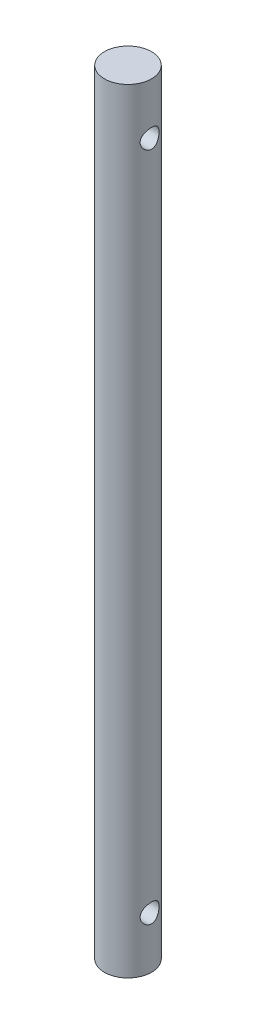
ISO-10303-21;
HEADER;
FILE_DESCRIPTION(('STEP AP214'),'2;1');
FILE_NAME('part.step','',(''),(''),'','','');
FILE_SCHEMA(('AUTOMOTIVE_DESIGN { 1 0 10303 214 1 1 1 1 }'));
ENDSEC;
DATA;
#1=APPLICATION_CONTEXT('core data for automotive mechanical design processes');
#2=APPLICATION_PROTOCOL_DEFINITION('international standard','automotive_design',2000,#1);
#3=PRODUCT_CONTEXT('',#1,'mechanical');
#4=PRODUCT('Part','Part','',(#3));
#5=PRODUCT_RELATED_PRODUCT_CATEGORY('part','',(#4));
#6=PRODUCT_DEFINITION_FORMATION('','',#4);
#7=PRODUCT_DEFINITION_CONTEXT('part definition',#1,'design');
#8=PRODUCT_DEFINITION('design','',#6,#7);
#9=PRODUCT_DEFINITION_SHAPE('','',#8);
#10=(LENGTH_UNIT() NAMED_UNIT(*) SI_UNIT(.MILLI.,.METRE.));
#11=(NAMED_UNIT(*) PLANE_ANGLE_UNIT() SI_UNIT($,.RADIAN.));
#12=(NAMED_UNIT(*) SI_UNIT($,.STERADIAN.) SOLID_ANGLE_UNIT());
#13=UNCERTAINTY_MEASURE_WITH_UNIT(LENGTH_MEASURE(1.E-05),#10,'distance_accuracy_value','');
#14=(GEOMETRIC_REPRESENTATION_CONTEXT(3) GLOBAL_UNCERTAINTY_ASSIGNED_CONTEXT((#13)) GLOBAL_UNIT_ASSIGNED_CONTEXT((#10,
#11,#12)) REPRESENTATION_CONTEXT('',''));
#15=CARTESIAN_POINT('',(0.,0.,0.));
#16=DIRECTION('',(0.,0.,1.));
#17=DIRECTION('',(1.,0.,0.));
#18=AXIS2_PLACEMENT_3D('',#15,#16,#17);
#19=CARTESIAN_POINT('',(0.,65.0875,0.));
#20=DIRECTION('',(0.,-1.,0.));
#21=DIRECTION('',(0.,0.,-1.));
#22=AXIS2_PLACEMENT_3D('',#19,#20,#21);
#23=CYLINDRICAL_SURFACE('',#22,3.9624);
#24=CARTESIAN_POINT('',(-3.9624,-58.0136,0.));
#25=CARTESIAN_POINT('',(-3.96239416664373,-58.0135921193011,-0.0853117270718672));
#26=CARTESIAN_POINT('',(-3.95961253187258,-58.00668204726,-0.170771012783032));
#27=CARTESIAN_POINT('',(-3.94875664272095,-57.9792813319248,-0.339280209794604));
#28=CARTESIAN_POINT('',(-3.94066802223273,-57.9587538243065,-0.422322940365626));
#29=CARTESIAN_POINT('',(-3.92006972049317,-57.9049852905155,-0.58328993969218));
#30=CARTESIAN_POINT('',(-3.90757454272,-57.8717859425204,-0.661230017057728));
#31=CARTESIAN_POINT('',(-3.87939329710751,-57.793781808147,-0.81036330158751));
#32=CARTESIAN_POINT('',(-3.863708331934,-57.7489810307651,-0.881558827817695));
#33=CARTESIAN_POINT('',(-3.82990464333274,-57.6468098336145,-1.01864732948285));
#34=CARTESIAN_POINT('',(-3.81171021752442,-57.5889813356325,-1.08418010359646));
#35=CARTESIAN_POINT('',(-3.7752829774358,-57.4633631362575,-1.20492218930694));
#36=CARTESIAN_POINT('',(-3.75705014873227,-57.3955685767368,-1.26012643608791));
#37=CARTESIAN_POINT('',(-3.72170442663272,-57.248264437137,-1.36107386243811));
#38=CARTESIAN_POINT('',(-3.70467796939796,-57.1683667700026,-1.40628412127964));
#39=CARTESIAN_POINT('',(-3.67486086596433,-57.0013169679372,-1.4824632905671));
#40=CARTESIAN_POINT('',(-3.66206820228051,-56.9141683130901,-1.51343898680089));
#41=CARTESIAN_POINT('',(-3.64298009307872,-56.7392293799378,-1.55881183659324));
#42=CARTESIAN_POINT('',(-3.63641570103484,-56.6516484051034,-1.57389868874412));
#43=CARTESIAN_POINT('',(-3.62974807106187,-56.4749708701643,-1.58921987839996));
#44=CARTESIAN_POINT('',(-3.62964164180919,-56.3858750804086,-1.58946155192944));
#45=CARTESIAN_POINT('',(-3.6356726055801,-56.2153342294068,-1.575608087631));
#46=CARTESIAN_POINT('',(-3.64137433896395,-56.1337895020417,-1.56251330699092));
#47=CARTESIAN_POINT('',(-3.65764778306397,-55.9741700246874,-1.5240270084585));
#48=CARTESIAN_POINT('',(-3.66822034656052,-55.896095884951,-1.49863333724794));
#49=CARTESIAN_POINT('',(-3.69327658525766,-55.7437469972858,-1.43578621930772));
#50=CARTESIAN_POINT('',(-3.7078358006729,-55.6695825564207,-1.39809683496274));
#51=CARTESIAN_POINT('',(-3.73920425029952,-55.5283576430005,-1.31189385068063));
#52=CARTESIAN_POINT('',(-3.75601433031439,-55.4612998579535,-1.26337617722401));
#53=CARTESIAN_POINT('',(-3.79157859533404,-55.3307177203381,-1.15247025125588));
#54=CARTESIAN_POINT('',(-3.81038243478567,-55.2678709868535,-1.08929797701747));
#55=CARTESIAN_POINT('',(-3.84670714404858,-55.153446296881,-0.953110948774039));
#56=CARTESIAN_POINT('',(-3.86422775624386,-55.1018705990245,-0.880094226746653));
#57=CARTESIAN_POINT('',(-3.89645338462923,-55.0105588621464,-0.724363732588354));
#58=CARTESIAN_POINT('',(-3.91109551133595,-54.9710785435517,-0.641486057700647));
#59=CARTESIAN_POINT('',(-3.93543864002888,-54.9068537921091,-0.469530085969012));
#60=CARTESIAN_POINT('',(-3.94514216003095,-54.8821018487075,-0.38045497535999));
#61=CARTESIAN_POINT('',(-3.95805539170234,-54.8494087183818,-0.204311847288934));
#62=CARTESIAN_POINT('',(-3.96161635318634,-54.8405569422447,-0.11743850460253));
#63=CARTESIAN_POINT('',(-3.96295024554235,-54.8372256723844,0.0566169135851261));
#64=CARTESIAN_POINT('',(-3.96072468264188,-54.8427424385421,0.143798902846545));
#65=CARTESIAN_POINT('',(-3.95096541555836,-54.867322787761,0.311864203819769));
#66=CARTESIAN_POINT('',(-3.94367566936803,-54.885764101533,0.392854247186954));
#67=CARTESIAN_POINT('',(-3.92477456539392,-54.9348226223705,0.550515216479774));
#68=CARTESIAN_POINT('',(-3.9131626527772,-54.9654413926807,0.627185586437011));
#69=CARTESIAN_POINT('',(-3.88630174678252,-55.0389847754524,0.776671825040636));
#70=CARTESIAN_POINT('',(-3.87095230097636,-55.0822573858858,0.849297865243658));
#71=CARTESIAN_POINT('',(-3.83827939599824,-55.1794941364002,0.986513042497234));
#72=CARTESIAN_POINT('',(-3.82095514553132,-55.2334625686897,1.05109893605944));
#73=CARTESIAN_POINT('',(-3.78479622435235,-55.354750435357,1.17488814946077));
#74=CARTESIAN_POINT('',(-3.76593750910618,-55.4227173731056,1.23345169378678));
#75=CARTESIAN_POINT('',(-3.72989598565993,-55.5678463207111,1.3384999511022));
#76=CARTESIAN_POINT('',(-3.71271345763364,-55.6450098630029,1.38498264693781));
#77=CARTESIAN_POINT('',(-3.68194013043205,-55.8075216147768,1.46485133239264));
#78=CARTESIAN_POINT('',(-3.66838637510373,-55.8929429536227,1.4981038159132));
#79=CARTESIAN_POINT('',(-3.64698112621987,-56.0688797769429,1.5494941460913));
#80=CARTESIAN_POINT('',(-3.63912540623532,-56.1593914319467,1.56764319695997));
#81=CARTESIAN_POINT('',(-3.63061804319504,-56.3359018207046,1.58723971665741));
#82=CARTESIAN_POINT('',(-3.62948746901891,-56.4217549205638,1.58979784556331));
#83=CARTESIAN_POINT('',(-3.63330307077312,-56.5926066827267,1.58105828726621));
#84=CARTESIAN_POINT('',(-3.63824846948727,-56.6776054529112,1.56976237222211));
#85=CARTESIAN_POINT('',(-3.65323574640425,-56.8408688823369,1.53454341699212));
#86=CARTESIAN_POINT('',(-3.66306695290778,-56.9192669177527,1.51114082490252));
#87=CARTESIAN_POINT('',(-3.6865691443393,-57.0710546597423,1.45286057138561));
#88=CARTESIAN_POINT('',(-3.70024119029212,-57.144442975417,1.41797973865852));
#89=CARTESIAN_POINT('',(-3.73085856653308,-57.2887155266046,1.3354212120285));
#90=CARTESIAN_POINT('',(-3.74794669035745,-57.3592145315965,1.28712414414707));
#91=CARTESIAN_POINT('',(-3.78303688506396,-57.4914557778298,1.1800080827382));
#92=CARTESIAN_POINT('',(-3.8010392318397,-57.5531953540747,1.12118589927164));
#93=CARTESIAN_POINT('',(-3.83733892894263,-57.6702920022108,0.99012923640903));
#94=CARTESIAN_POINT('',(-3.85557912432534,-57.7249714588259,0.917270721586572));
#95=CARTESIAN_POINT('',(-3.88910173721633,-57.8213427946702,0.762721357089438));
#96=CARTESIAN_POINT('',(-3.90438277937339,-57.8630286402073,0.681026427799038));
#97=CARTESIAN_POINT('',(-3.93000833052496,-57.9312546874147,0.512612293189795));
#98=CARTESIAN_POINT('',(-3.94043917717235,-57.9580615688017,0.426014442405739));
#99=CARTESIAN_POINT('',(-3.95554325966711,-57.9965098677266,0.249201615949019));
#100=CARTESIAN_POINT('',(-3.96023475540089,-58.0081993883373,0.158999059586055));
#101=CARTESIAN_POINT('',(-3.96220361378713,-58.0131081223784,0.045733089980388));
#102=CARTESIAN_POINT('',(-3.96240156390736,-58.0136021127945,0.0228718479665298));
#103=CARTESIAN_POINT('',(-3.9624,-58.0136,0.));
#104=B_SPLINE_CURVE_WITH_KNOTS('',3,(#24,#25,#26,#27,#28,#29,#30,#31,#32,#33,#34,#35,#36,#37,
#38,#39,#40,#41,#42,#43,#44,#45,#46,#47,#48,#49,#50,#51,#52,#53,#54,#55,#56,#57,#58,#59,#60,#61,
#62,#63,#64,#65,#66,#67,#68,#69,#70,#71,#72,#73,#74,#75,#76,#77,#78,#79,#80,#81,#82,#83,#84,#85,
#86,#87,#88,#89,#90,#91,#92,#93,#94,#95,#96,#97,#98,#99,#100,#101,#102,#103),.UNSPECIFIED.,.T.,
.F.,(4,2,2,2,2,2,2,2,2,2,2,2,2,2,2,2,2,2,2,2,2,2,2,2,2,2,2,2,2,2,2,2,2,2,2,2,2,2,2,4),(0.,
0.255873929494163,0.512443388183723,0.768176151866853,1.02382066204937,1.2904702136267,
1.55725018179778,1.83594980248179,2.11451642551445,2.38041834160663,2.64618885620301,
2.89339325556368,3.14064095169739,3.39294340285309,3.64534092872686,3.9173176007395,
4.1893487249715,4.46678713369948,4.74408394461069,5.00492203806861,5.26569224238361,
5.51470010088075,5.76373993534177,6.02040300035022,6.27716927297268,6.55094094110411,
6.82475829189516,7.10127261999539,7.37758163757343,7.63395264349523,7.89029085879074,
8.13642690153649,8.38263100588646,8.64296045355352,8.90336893560794,9.18073833868854,
9.45823634935122,9.73058529806196,10.0020654893605,10.0706646118358),.UNSPECIFIED.);
#105=CARTESIAN_POINT('',(-3.9624,-58.0136,0.));
#106=VERTEX_POINT('',#105);
#107=EDGE_CURVE('E41',#106,#106,#104,.T.);
#108=ORIENTED_EDGE('',*,*,#107,.T.);
#109=EDGE_LOOP('',(#108));
#110=FACE_BOUND('',#109,.T.);
#111=CARTESIAN_POINT('',(3.9624,-58.0136,0.));
#112=CARTESIAN_POINT('',(3.96239416664373,-58.0135921193011,0.085311727071867));
#113=CARTESIAN_POINT('',(3.95961253187258,-58.00668204726,0.170771012783032));
#114=CARTESIAN_POINT('',(3.94875664272095,-57.9792813319248,0.339280209794604));
#115=CARTESIAN_POINT('',(3.94066802223273,-57.9587538243066,0.422322940365625));
#116=CARTESIAN_POINT('',(3.92006972049317,-57.9049852905155,0.583289939692178));
#117=CARTESIAN_POINT('',(3.90757454272,-57.8717859425204,0.661230017057726));
#118=CARTESIAN_POINT('',(3.87939329710751,-57.793781808147,0.810363301587508));
#119=CARTESIAN_POINT('',(3.863708331934,-57.7489810307651,0.881558827817696));
#120=CARTESIAN_POINT('',(3.82990464333274,-57.6468098336145,1.01864732948285));
#121=CARTESIAN_POINT('',(3.81171021752442,-57.5889813356325,1.08418010359647));
#122=CARTESIAN_POINT('',(3.7752829774358,-57.4633631362575,1.20492218930694));
#123=CARTESIAN_POINT('',(3.75705014873227,-57.3955685767368,1.26012643608792));
#124=CARTESIAN_POINT('',(3.72170442663272,-57.248264437137,1.36107386243811));
#125=CARTESIAN_POINT('',(3.70467796939796,-57.1683667700026,1.40628412127965));
#126=CARTESIAN_POINT('',(3.67486086596433,-57.0013169679372,1.4824632905671));
#127=CARTESIAN_POINT('',(3.66206820228051,-56.9141683130901,1.51343898680089));
#128=CARTESIAN_POINT('',(3.64298009307872,-56.7392293799378,1.55881183659324));
#129=CARTESIAN_POINT('',(3.63641570103485,-56.6516484051034,1.57389868874412));
#130=CARTESIAN_POINT('',(3.62974807106187,-56.4749708701643,1.58921987839996));
#131=CARTESIAN_POINT('',(3.62964164180919,-56.3858750804086,1.58946155192944));
#132=CARTESIAN_POINT('',(3.6356726055801,-56.2153342294068,1.575608087631));
#133=CARTESIAN_POINT('',(3.64137433896395,-56.1337895020417,1.56251330699092));
#134=CARTESIAN_POINT('',(3.65764778306397,-55.9741700246874,1.5240270084585));
#135=CARTESIAN_POINT('',(3.66822034656052,-55.896095884951,1.49863333724794));
#136=CARTESIAN_POINT('',(3.69327658525766,-55.7437469972858,1.43578621930772));
#137=CARTESIAN_POINT('',(3.7078358006729,-55.6695825564207,1.39809683496274));
#138=CARTESIAN_POINT('',(3.73920425029952,-55.5283576430005,1.31189385068063));
#139=CARTESIAN_POINT('',(3.75601433031439,-55.4612998579535,1.26337617722401));
#140=CARTESIAN_POINT('',(3.79157859533404,-55.3307177203381,1.15247025125588));
#141=CARTESIAN_POINT('',(3.81038243478568,-55.2678709868535,1.08929797701747));
#142=CARTESIAN_POINT('',(3.84670714404858,-55.153446296881,0.953110948774042));
#143=CARTESIAN_POINT('',(3.86422775624386,-55.1018705990245,0.880094226746658));
#144=CARTESIAN_POINT('',(3.89645338462923,-55.0105588621464,0.72436373258836));
#145=CARTESIAN_POINT('',(3.91109551133595,-54.9710785435517,0.641486057700653));
#146=CARTESIAN_POINT('',(3.93543864002888,-54.9068537921091,0.469530085969017));
#147=CARTESIAN_POINT('',(3.94514216003095,-54.8821018487075,0.380454975359994));
#148=CARTESIAN_POINT('',(3.95805539170234,-54.8494087183818,0.204311847288937));
#149=CARTESIAN_POINT('',(3.96161635318634,-54.8405569422447,0.117438504602533));
#150=CARTESIAN_POINT('',(3.96295024554235,-54.8372256723844,-0.0566169135851239));
#151=CARTESIAN_POINT('',(3.96072468264188,-54.8427424385421,-0.143798902846543));
#152=CARTESIAN_POINT('',(3.95096541555836,-54.867322787761,-0.311864203819767));
#153=CARTESIAN_POINT('',(3.94367566936803,-54.885764101533,-0.392854247186952));
#154=CARTESIAN_POINT('',(3.92477456539392,-54.9348226223705,-0.550515216479773));
#155=CARTESIAN_POINT('',(3.9131626527772,-54.9654413926807,-0.627185586437011));
#156=CARTESIAN_POINT('',(3.88630174678252,-55.0389847754524,-0.776671825040636));
#157=CARTESIAN_POINT('',(3.87095230097636,-55.0822573858858,-0.849297865243657));
#158=CARTESIAN_POINT('',(3.83827939599824,-55.1794941364002,-0.986513042497233));
#159=CARTESIAN_POINT('',(3.82095514553132,-55.2334625686897,-1.05109893605943));
#160=CARTESIAN_POINT('',(3.78479622435235,-55.354750435357,-1.17488814946077));
#161=CARTESIAN_POINT('',(3.76593750910618,-55.4227173731056,-1.23345169378678));
#162=CARTESIAN_POINT('',(3.72989598565993,-55.5678463207111,-1.3384999511022));
#163=CARTESIAN_POINT('',(3.71271345763364,-55.6450098630029,-1.38498264693781));
#164=CARTESIAN_POINT('',(3.68194013043205,-55.8075216147768,-1.46485133239264));
#165=CARTESIAN_POINT('',(3.66838637510373,-55.8929429536227,-1.4981038159132));
#166=CARTESIAN_POINT('',(3.64698112621987,-56.0688797769429,-1.5494941460913));
#167=CARTESIAN_POINT('',(3.63912540623532,-56.1593914319467,-1.56764319695997));
#168=CARTESIAN_POINT('',(3.63061804319504,-56.3359018207046,-1.58723971665742));
#169=CARTESIAN_POINT('',(3.62948746901891,-56.4217549205638,-1.58979784556331));
#170=CARTESIAN_POINT('',(3.63330307077312,-56.5926066827267,-1.58105828726621));
#171=CARTESIAN_POINT('',(3.63824846948727,-56.6776054529112,-1.56976237222211));
#172=CARTESIAN_POINT('',(3.65323574640425,-56.8408688823369,-1.53454341699212));
#173=CARTESIAN_POINT('',(3.66306695290778,-56.9192669177527,-1.51114082490252));
#174=CARTESIAN_POINT('',(3.6865691443393,-57.0710546597423,-1.45286057138561));
#175=CARTESIAN_POINT('',(3.70024119029212,-57.144442975417,-1.41797973865852));
#176=CARTESIAN_POINT('',(3.73085856653308,-57.2887155266046,-1.3354212120285));
#177=CARTESIAN_POINT('',(3.74794669035745,-57.3592145315965,-1.28712414414707));
#178=CARTESIAN_POINT('',(3.78303688506396,-57.4914557778298,-1.18000808273821));
#179=CARTESIAN_POINT('',(3.8010392318397,-57.5531953540747,-1.12118589927164));
#180=CARTESIAN_POINT('',(3.83733892894263,-57.6702920022108,-0.990129236409032));
#181=CARTESIAN_POINT('',(3.85557912432534,-57.7249714588259,-0.917270721586572));
#182=CARTESIAN_POINT('',(3.88910173721633,-57.8213427946702,-0.762721357089437));
#183=CARTESIAN_POINT('',(3.90438277937339,-57.8630286402073,-0.681026427799038));
#184=CARTESIAN_POINT('',(3.93000833052496,-57.9312546874147,-0.512612293189793));
#185=CARTESIAN_POINT('',(3.94043917717235,-57.9580615688017,-0.426014442405736));
#186=CARTESIAN_POINT('',(3.95554325966711,-57.9965098677266,-0.249201615949015));
#187=CARTESIAN_POINT('',(3.96023475540089,-58.0081993883373,-0.158999059586051));
#188=CARTESIAN_POINT('',(3.96220361378713,-58.0131081223784,-0.045733089980385));
#189=CARTESIAN_POINT('',(3.96240156390736,-58.0136021127945,-0.0228718479665283));
#190=CARTESIAN_POINT('',(3.9624,-58.0136,0.));
#191=B_SPLINE_CURVE_WITH_KNOTS('',3,(#111,#112,#113,#114,#115,#116,#117,#118,#119,#120,#121,
#122,#123,#124,#125,#126,#127,#128,#129,#130,#131,#132,#133,#134,#135,#136,#137,#138,#139,#140,
#141,#142,#143,#144,#145,#146,#147,#148,#149,#150,#151,#152,#153,#154,#155,#156,#157,#158,#159,
#160,#161,#162,#163,#164,#165,#166,#167,#168,#169,#170,#171,#172,#173,#174,#175,#176,#177,#178,
#179,#180,#181,#182,#183,#184,#185,#186,#187,#188,#189,#190),.UNSPECIFIED.,.T.,.F.,(4,2,2,2,2,2,
2,2,2,2,2,2,2,2,2,2,2,2,2,2,2,2,2,2,2,2,2,2,2,2,2,2,2,2,2,2,2,2,2,4),(0.,0.255873929494162,
0.512443388183724,0.768176151866852,1.02382066204937,1.2904702136267,1.55725018179778,
1.8359498024818,2.11451642551445,2.38041834160663,2.64618885620301,2.89339325556369,
3.1406409516974,3.39294340285309,3.64534092872686,3.9173176007395,4.1893487249715,
4.46678713369947,4.74408394461069,5.00492203806861,5.26569224238361,5.51470010088075,
5.76373993534177,6.02040300035022,6.27716927297268,6.55094094110412,6.82475829189516,
7.10127261999539,7.37758163757343,7.63395264349523,7.89029085879074,8.1364269015365,
8.38263100588646,8.64296045355351,8.90336893560794,9.18073833868855,9.45823634935123,
9.73058529806197,10.0020654893605,10.0706646118358),.UNSPECIFIED.);
#192=CARTESIAN_POINT('',(3.9624,-58.0136,0.));
#193=VERTEX_POINT('',#192);
#194=EDGE_CURVE('E96',#193,#193,#191,.T.);
#195=ORIENTED_EDGE('',*,*,#194,.T.);
#196=EDGE_LOOP('',(#195));
#197=FACE_BOUND('',#196,.T.);
#198=CARTESIAN_POINT('',(-3.9624,58.0136,0.));
#199=CARTESIAN_POINT('',(-3.96239416664373,58.0135921193011,0.0853117270718672));
#200=CARTESIAN_POINT('',(-3.95961253187258,58.00668204726,0.170771012783032));
#201=CARTESIAN_POINT('',(-3.94875664272095,57.9792813319248,0.339280209794604));
#202=CARTESIAN_POINT('',(-3.94066802223273,57.9587538243065,0.422322940365626));
#203=CARTESIAN_POINT('',(-3.92006972049317,57.9049852905155,0.58328993969218));
#204=CARTESIAN_POINT('',(-3.90757454272,57.8717859425204,0.661230017057728));
#205=CARTESIAN_POINT('',(-3.87939329710751,57.793781808147,0.81036330158751));
#206=CARTESIAN_POINT('',(-3.863708331934,57.7489810307651,0.881558827817695));
#207=CARTESIAN_POINT('',(-3.82990464333274,57.6468098336145,1.01864732948285));
#208=CARTESIAN_POINT('',(-3.81171021752442,57.5889813356325,1.08418010359646));
#209=CARTESIAN_POINT('',(-3.7752829774358,57.4633631362575,1.20492218930694));
#210=CARTESIAN_POINT('',(-3.75705014873227,57.3955685767368,1.26012643608791));
#211=CARTESIAN_POINT('',(-3.72170442663272,57.248264437137,1.36107386243811));
#212=CARTESIAN_POINT('',(-3.70467796939796,57.1683667700026,1.40628412127964));
#213=CARTESIAN_POINT('',(-3.67486086596433,57.0013169679372,1.4824632905671));
#214=CARTESIAN_POINT('',(-3.66206820228051,56.9141683130901,1.51343898680089));
#215=CARTESIAN_POINT('',(-3.64298009307872,56.7392293799378,1.55881183659324));
#216=CARTESIAN_POINT('',(-3.63641570103484,56.6516484051034,1.57389868874412));
#217=CARTESIAN_POINT('',(-3.62974807106187,56.4749708701643,1.58921987839996));
#218=CARTESIAN_POINT('',(-3.62964164180919,56.3858750804086,1.58946155192944));
#219=CARTESIAN_POINT('',(-3.6356726055801,56.2153342294068,1.575608087631));
#220=CARTESIAN_POINT('',(-3.64137433896395,56.1337895020417,1.56251330699092));
#221=CARTESIAN_POINT('',(-3.65764778306397,55.9741700246874,1.5240270084585));
#222=CARTESIAN_POINT('',(-3.66822034656052,55.896095884951,1.49863333724794));
#223=CARTESIAN_POINT('',(-3.69327658525766,55.7437469972858,1.43578621930772));
#224=CARTESIAN_POINT('',(-3.7078358006729,55.6695825564207,1.39809683496274));
#225=CARTESIAN_POINT('',(-3.73920425029952,55.5283576430005,1.31189385068063));
#226=CARTESIAN_POINT('',(-3.75601433031439,55.4612998579535,1.26337617722401));
#227=CARTESIAN_POINT('',(-3.79157859533404,55.3307177203381,1.15247025125588));
#228=CARTESIAN_POINT('',(-3.81038243478567,55.2678709868535,1.08929797701747));
#229=CARTESIAN_POINT('',(-3.84670714404858,55.153446296881,0.953110948774039));
#230=CARTESIAN_POINT('',(-3.86422775624386,55.1018705990245,0.880094226746653));
#231=CARTESIAN_POINT('',(-3.89645338462923,55.0105588621464,0.724363732588354));
#232=CARTESIAN_POINT('',(-3.91109551133595,54.9710785435517,0.641486057700647));
#233=CARTESIAN_POINT('',(-3.93543864002888,54.9068537921091,0.469530085969012));
#234=CARTESIAN_POINT('',(-3.94514216003095,54.8821018487075,0.38045497535999));
#235=CARTESIAN_POINT('',(-3.95805539170234,54.8494087183818,0.204311847288934));
#236=CARTESIAN_POINT('',(-3.96161635318634,54.8405569422447,0.11743850460253));
#237=CARTESIAN_POINT('',(-3.96295024554235,54.8372256723844,-0.0566169135851261));
#238=CARTESIAN_POINT('',(-3.96072468264188,54.8427424385421,-0.143798902846545));
#239=CARTESIAN_POINT('',(-3.95096541555836,54.867322787761,-0.311864203819769));
#240=CARTESIAN_POINT('',(-3.94367566936803,54.885764101533,-0.392854247186954));
#241=CARTESIAN_POINT('',(-3.92477456539392,54.9348226223705,-0.550515216479774));
#242=CARTESIAN_POINT('',(-3.9131626527772,54.9654413926807,-0.627185586437011));
#243=CARTESIAN_POINT('',(-3.88630174678252,55.0389847754524,-0.776671825040636));
#244=CARTESIAN_POINT('',(-3.87095230097636,55.0822573858858,-0.849297865243658));
#245=CARTESIAN_POINT('',(-3.83827939599824,55.1794941364002,-0.986513042497234));
#246=CARTESIAN_POINT('',(-3.82095514553132,55.2334625686897,-1.05109893605944));
#247=CARTESIAN_POINT('',(-3.78479622435235,55.354750435357,-1.17488814946077));
#248=CARTESIAN_POINT('',(-3.76593750910618,55.4227173731056,-1.23345169378678));
#249=CARTESIAN_POINT('',(-3.72989598565993,55.5678463207111,-1.3384999511022));
#250=CARTESIAN_POINT('',(-3.71271345763364,55.6450098630029,-1.38498264693781));
#251=CARTESIAN_POINT('',(-3.68194013043205,55.8075216147768,-1.46485133239264));
#252=CARTESIAN_POINT('',(-3.66838637510373,55.8929429536227,-1.4981038159132));
#253=CARTESIAN_POINT('',(-3.64698112621987,56.0688797769429,-1.5494941460913));
#254=CARTESIAN_POINT('',(-3.63912540623532,56.1593914319467,-1.56764319695997));
#255=CARTESIAN_POINT('',(-3.63061804319504,56.3359018207046,-1.58723971665741));
#256=CARTESIAN_POINT('',(-3.62948746901891,56.4217549205638,-1.58979784556331));
#257=CARTESIAN_POINT('',(-3.63330307077312,56.5926066827267,-1.58105828726621));
#258=CARTESIAN_POINT('',(-3.63824846948727,56.6776054529112,-1.56976237222211));
#259=CARTESIAN_POINT('',(-3.65323574640425,56.8408688823369,-1.53454341699212));
#260=CARTESIAN_POINT('',(-3.66306695290778,56.9192669177527,-1.51114082490252));
#261=CARTESIAN_POINT('',(-3.6865691443393,57.0710546597423,-1.45286057138561));
#262=CARTESIAN_POINT('',(-3.70024119029212,57.144442975417,-1.41797973865852));
#263=CARTESIAN_POINT('',(-3.73085856653308,57.2887155266046,-1.3354212120285));
#264=CARTESIAN_POINT('',(-3.74794669035745,57.3592145315965,-1.28712414414707));
#265=CARTESIAN_POINT('',(-3.78303688506396,57.4914557778298,-1.1800080827382));
#266=CARTESIAN_POINT('',(-3.8010392318397,57.5531953540747,-1.12118589927164));
#267=CARTESIAN_POINT('',(-3.83733892894263,57.6702920022108,-0.99012923640903));
#268=CARTESIAN_POINT('',(-3.85557912432534,57.7249714588259,-0.917270721586572));
#269=CARTESIAN_POINT('',(-3.88910173721633,57.8213427946702,-0.762721357089438));
#270=CARTESIAN_POINT('',(-3.90438277937339,57.8630286402073,-0.681026427799038));
#271=CARTESIAN_POINT('',(-3.93000833052496,57.9312546874147,-0.512612293189795));
#272=CARTESIAN_POINT('',(-3.94043917717235,57.9580615688017,-0.426014442405739));
#273=CARTESIAN_POINT('',(-3.95554325966711,57.9965098677266,-0.249201615949019));
#274=CARTESIAN_POINT('',(-3.96023475540089,58.0081993883373,-0.158999059586055));
#275=CARTESIAN_POINT('',(-3.96220361378713,58.0131081223784,-0.045733089980388));
#276=CARTESIAN_POINT('',(-3.96240156390736,58.0136021127945,-0.0228718479665298));
#277=CARTESIAN_POINT('',(-3.9624,58.0136,0.));
#278=B_SPLINE_CURVE_WITH_KNOTS('',3,(#198,#199,#200,#201,#202,#203,#204,#205,#206,#207,#208,
#209,#210,#211,#212,#213,#214,#215,#216,#217,#218,#219,#220,#221,#222,#223,#224,#225,#226,#227,
#228,#229,#230,#231,#232,#233,#234,#235,#236,#237,#238,#239,#240,#241,#242,#243,#244,#245,#246,
#247,#248,#249,#250,#251,#252,#253,#254,#255,#256,#257,#258,#259,#260,#261,#262,#263,#264,#265,
#266,#267,#268,#269,#270,#271,#272,#273,#274,#275,#276,#277),.UNSPECIFIED.,.T.,.F.,(4,2,2,2,2,2,
2,2,2,2,2,2,2,2,2,2,2,2,2,2,2,2,2,2,2,2,2,2,2,2,2,2,2,2,2,2,2,2,2,4),(0.,0.255873929494163,
0.512443388183723,0.768176151866853,1.02382066204937,1.2904702136267,1.55725018179778,
1.83594980248179,2.11451642551445,2.38041834160663,2.64618885620301,2.89339325556368,
3.14064095169739,3.39294340285309,3.64534092872686,3.9173176007395,4.1893487249715,
4.46678713369948,4.74408394461069,5.00492203806861,5.26569224238361,5.51470010088075,
5.76373993534177,6.02040300035022,6.27716927297268,6.55094094110411,6.82475829189516,
7.10127261999539,7.37758163757343,7.63395264349523,7.89029085879074,8.13642690153649,
8.38263100588646,8.64296045355352,8.90336893560794,9.18073833868854,9.45823634935122,
9.73058529806196,10.0020654893605,10.0706646118358),.UNSPECIFIED.);
#279=CARTESIAN_POINT('',(-3.9624,58.0136,0.));
#280=VERTEX_POINT('',#279);
#281=EDGE_CURVE('E56',#280,#280,#278,.T.);
#282=ORIENTED_EDGE('',*,*,#281,.T.);
#283=EDGE_LOOP('',(#282));
#284=FACE_BOUND('',#283,.T.);
#285=CARTESIAN_POINT('',(3.9624,58.0136,0.));
#286=CARTESIAN_POINT('',(3.96239416664373,58.0135921193011,-0.085311727071867));
#287=CARTESIAN_POINT('',(3.95961253187258,58.00668204726,-0.170771012783032));
#288=CARTESIAN_POINT('',(3.94875664272095,57.9792813319248,-0.339280209794604));
#289=CARTESIAN_POINT('',(3.94066802223273,57.9587538243066,-0.422322940365625));
#290=CARTESIAN_POINT('',(3.92006972049317,57.9049852905155,-0.583289939692178));
#291=CARTESIAN_POINT('',(3.90757454272,57.8717859425204,-0.661230017057726));
#292=CARTESIAN_POINT('',(3.87939329710751,57.793781808147,-0.810363301587508));
#293=CARTESIAN_POINT('',(3.863708331934,57.7489810307651,-0.881558827817696));
#294=CARTESIAN_POINT('',(3.82990464333274,57.6468098336145,-1.01864732948285));
#295=CARTESIAN_POINT('',(3.81171021752442,57.5889813356325,-1.08418010359647));
#296=CARTESIAN_POINT('',(3.7752829774358,57.4633631362575,-1.20492218930694));
#297=CARTESIAN_POINT('',(3.75705014873227,57.3955685767368,-1.26012643608792));
#298=CARTESIAN_POINT('',(3.72170442663272,57.248264437137,-1.36107386243811));
#299=CARTESIAN_POINT('',(3.70467796939796,57.1683667700026,-1.40628412127965));
#300=CARTESIAN_POINT('',(3.67486086596433,57.0013169679372,-1.4824632905671));
#301=CARTESIAN_POINT('',(3.66206820228051,56.9141683130901,-1.51343898680089));
#302=CARTESIAN_POINT('',(3.64298009307872,56.7392293799378,-1.55881183659324));
#303=CARTESIAN_POINT('',(3.63641570103485,56.6516484051034,-1.57389868874412));
#304=CARTESIAN_POINT('',(3.62974807106187,56.4749708701643,-1.58921987839996));
#305=CARTESIAN_POINT('',(3.62964164180919,56.3858750804086,-1.58946155192944));
#306=CARTESIAN_POINT('',(3.6356726055801,56.2153342294068,-1.575608087631));
#307=CARTESIAN_POINT('',(3.64137433896395,56.1337895020417,-1.56251330699092));
#308=CARTESIAN_POINT('',(3.65764778306397,55.9741700246874,-1.5240270084585));
#309=CARTESIAN_POINT('',(3.66822034656052,55.896095884951,-1.49863333724794));
#310=CARTESIAN_POINT('',(3.69327658525766,55.7437469972858,-1.43578621930772));
#311=CARTESIAN_POINT('',(3.7078358006729,55.6695825564207,-1.39809683496274));
#312=CARTESIAN_POINT('',(3.73920425029952,55.5283576430005,-1.31189385068063));
#313=CARTESIAN_POINT('',(3.75601433031439,55.4612998579535,-1.26337617722401));
#314=CARTESIAN_POINT('',(3.79157859533404,55.3307177203381,-1.15247025125588));
#315=CARTESIAN_POINT('',(3.81038243478568,55.2678709868535,-1.08929797701747));
#316=CARTESIAN_POINT('',(3.84670714404858,55.153446296881,-0.953110948774042));
#317=CARTESIAN_POINT('',(3.86422775624386,55.1018705990245,-0.880094226746658));
#318=CARTESIAN_POINT('',(3.89645338462923,55.0105588621464,-0.72436373258836));
#319=CARTESIAN_POINT('',(3.91109551133595,54.9710785435517,-0.641486057700653));
#320=CARTESIAN_POINT('',(3.93543864002888,54.9068537921091,-0.469530085969017));
#321=CARTESIAN_POINT('',(3.94514216003095,54.8821018487075,-0.380454975359994));
#322=CARTESIAN_POINT('',(3.95805539170234,54.8494087183818,-0.204311847288937));
#323=CARTESIAN_POINT('',(3.96161635318634,54.8405569422447,-0.117438504602533));
#324=CARTESIAN_POINT('',(3.96295024554235,54.8372256723844,0.0566169135851239));
#325=CARTESIAN_POINT('',(3.96072468264188,54.8427424385421,0.143798902846543));
#326=CARTESIAN_POINT('',(3.95096541555836,54.867322787761,0.311864203819767));
#327=CARTESIAN_POINT('',(3.94367566936803,54.885764101533,0.392854247186952));
#328=CARTESIAN_POINT('',(3.92477456539392,54.9348226223705,0.550515216479773));
#329=CARTESIAN_POINT('',(3.9131626527772,54.9654413926807,0.627185586437011));
#330=CARTESIAN_POINT('',(3.88630174678252,55.0389847754524,0.776671825040636));
#331=CARTESIAN_POINT('',(3.87095230097636,55.0822573858858,0.849297865243657));
#332=CARTESIAN_POINT('',(3.83827939599824,55.1794941364002,0.986513042497233));
#333=CARTESIAN_POINT('',(3.82095514553132,55.2334625686897,1.05109893605943));
#334=CARTESIAN_POINT('',(3.78479622435235,55.354750435357,1.17488814946077));
#335=CARTESIAN_POINT('',(3.76593750910618,55.4227173731056,1.23345169378678));
#336=CARTESIAN_POINT('',(3.72989598565993,55.5678463207111,1.3384999511022));
#337=CARTESIAN_POINT('',(3.71271345763364,55.6450098630029,1.38498264693781));
#338=CARTESIAN_POINT('',(3.68194013043205,55.8075216147768,1.46485133239264));
#339=CARTESIAN_POINT('',(3.66838637510373,55.8929429536227,1.4981038159132));
#340=CARTESIAN_POINT('',(3.64698112621987,56.0688797769429,1.5494941460913));
#341=CARTESIAN_POINT('',(3.63912540623532,56.1593914319467,1.56764319695997));
#342=CARTESIAN_POINT('',(3.63061804319504,56.3359018207046,1.58723971665742));
#343=CARTESIAN_POINT('',(3.62948746901891,56.4217549205638,1.58979784556331));
#344=CARTESIAN_POINT('',(3.63330307077312,56.5926066827267,1.58105828726621));
#345=CARTESIAN_POINT('',(3.63824846948727,56.6776054529112,1.56976237222211));
#346=CARTESIAN_POINT('',(3.65323574640425,56.8408688823369,1.53454341699212));
#347=CARTESIAN_POINT('',(3.66306695290778,56.9192669177527,1.51114082490252));
#348=CARTESIAN_POINT('',(3.6865691443393,57.0710546597423,1.45286057138561));
#349=CARTESIAN_POINT('',(3.70024119029212,57.144442975417,1.41797973865852));
#350=CARTESIAN_POINT('',(3.73085856653308,57.2887155266046,1.3354212120285));
#351=CARTESIAN_POINT('',(3.74794669035745,57.3592145315965,1.28712414414707));
#352=CARTESIAN_POINT('',(3.78303688506396,57.4914557778298,1.18000808273821));
#353=CARTESIAN_POINT('',(3.8010392318397,57.5531953540747,1.12118589927164));
#354=CARTESIAN_POINT('',(3.83733892894263,57.6702920022108,0.990129236409032));
#355=CARTESIAN_POINT('',(3.85557912432534,57.7249714588259,0.917270721586572));
#356=CARTESIAN_POINT('',(3.88910173721633,57.8213427946702,0.762721357089437));
#357=CARTESIAN_POINT('',(3.90438277937339,57.8630286402073,0.681026427799038));
#358=CARTESIAN_POINT('',(3.93000833052496,57.9312546874147,0.512612293189793));
#359=CARTESIAN_POINT('',(3.94043917717235,57.9580615688017,0.426014442405736));
#360=CARTESIAN_POINT('',(3.95554325966711,57.9965098677266,0.249201615949015));
#361=CARTESIAN_POINT('',(3.96023475540089,58.0081993883373,0.158999059586051));
#362=CARTESIAN_POINT('',(3.96220361378713,58.0131081223784,0.045733089980385));
#363=CARTESIAN_POINT('',(3.96240156390736,58.0136021127945,0.0228718479665283));
#364=CARTESIAN_POINT('',(3.9624,58.0136,0.));
#365=B_SPLINE_CURVE_WITH_KNOTS('',3,(#285,#286,#287,#288,#289,#290,#291,#292,#293,#294,#295,
#296,#297,#298,#299,#300,#301,#302,#303,#304,#305,#306,#307,#308,#309,#310,#311,#312,#313,#314,
#315,#316,#317,#318,#319,#320,#321,#322,#323,#324,#325,#326,#327,#328,#329,#330,#331,#332,#333,
#334,#335,#336,#337,#338,#339,#340,#341,#342,#343,#344,#345,#346,#347,#348,#349,#350,#351,#352,
#353,#354,#355,#356,#357,#358,#359,#360,#361,#362,#363,#364),.UNSPECIFIED.,.T.,.F.,(4,2,2,2,2,2,
2,2,2,2,2,2,2,2,2,2,2,2,2,2,2,2,2,2,2,2,2,2,2,2,2,2,2,2,2,2,2,2,2,4),(0.,0.255873929494162,
0.512443388183724,0.768176151866852,1.02382066204937,1.2904702136267,1.55725018179778,
1.8359498024818,2.11451642551445,2.38041834160663,2.64618885620301,2.89339325556369,
3.1406409516974,3.39294340285309,3.64534092872686,3.9173176007395,4.1893487249715,
4.46678713369947,4.74408394461069,5.00492203806861,5.26569224238361,5.51470010088075,
5.76373993534177,6.02040300035022,6.27716927297268,6.55094094110412,6.82475829189516,
7.10127261999539,7.37758163757343,7.63395264349523,7.89029085879074,8.1364269015365,
8.38263100588646,8.64296045355351,8.90336893560794,9.18073833868855,9.45823634935123,
9.73058529806197,10.0020654893605,10.0706646118358),.UNSPECIFIED.);
#366=CARTESIAN_POINT('',(3.9624,58.0136,0.));
#367=VERTEX_POINT('',#366);
#368=EDGE_CURVE('E59',#367,#367,#365,.T.);
#369=ORIENTED_EDGE('',*,*,#368,.T.);
#370=EDGE_LOOP('',(#369));
#371=FACE_BOUND('',#370,.T.);
#372=CARTESIAN_POINT('',(0.,65.0875,0.));
#373=DIRECTION('',(0.,1.,0.));
#374=DIRECTION('',(0.,0.,1.));
#375=AXIS2_PLACEMENT_3D('',#372,#373,#374);
#376=CIRCLE('',#375,3.9624);
#377=CARTESIAN_POINT('',(0.,65.0875,3.9624));
#378=VERTEX_POINT('',#377);
#379=EDGE_CURVE('E10',#378,#378,#376,.T.);
#380=ORIENTED_EDGE('',*,*,#379,.F.);
#381=EDGE_LOOP('',(#380));
#382=FACE_BOUND('',#381,.T.);
#383=CARTESIAN_POINT('',(0.,-65.0875,0.));
#384=DIRECTION('',(0.,1.,0.));
#385=DIRECTION('',(0.,0.,1.));
#386=AXIS2_PLACEMENT_3D('',#383,#384,#385);
#387=CIRCLE('',#386,3.9624);
#388=CARTESIAN_POINT('',(0.,-65.0875,3.9624));
#389=VERTEX_POINT('',#388);
#390=EDGE_CURVE('E50',#389,#389,#387,.T.);
#391=ORIENTED_EDGE('',*,*,#390,.T.);
#392=EDGE_LOOP('',(#391));
#393=FACE_BOUND('',#392,.T.);
#394=ADVANCED_FACE('F37',(#110,#197,#284,#371,#382,#393),#23,.T.);
#395=CARTESIAN_POINT('',(0.,65.0875,0.));
#396=DIRECTION('',(0.,1.,0.));
#397=DIRECTION('',(0.,0.,1.));
#398=AXIS2_PLACEMENT_3D('',#395,#396,#397);
#399=PLANE('',#398);
#400=ORIENTED_EDGE('',*,*,#379,.T.);
#401=EDGE_LOOP('',(#400));
#402=FACE_BOUND('',#401,.T.);
#403=ADVANCED_FACE('F78',(#402),#399,.T.);
#404=CARTESIAN_POINT('',(0.,-65.0875,0.));
#405=DIRECTION('',(0.,1.,0.));
#406=DIRECTION('',(0.,0.,1.));
#407=AXIS2_PLACEMENT_3D('',#404,#405,#406);
#408=PLANE('',#407);
#409=ORIENTED_EDGE('',*,*,#390,.F.);
#410=EDGE_LOOP('',(#409));
#411=FACE_BOUND('',#410,.T.);
#412=ADVANCED_FACE('F75',(#411),#408,.F.);
#413=CARTESIAN_POINT('',(14.986737011626,56.4261,0.));
#414=DIRECTION('',(1.,0.,0.));
#415=DIRECTION('',(0.,1.,0.));
#416=AXIS2_PLACEMENT_3D('',#413,#414,#415);
#417=CYLINDRICAL_SURFACE('',#416,1.5875);
#418=ORIENTED_EDGE('',*,*,#368,.F.);
#419=EDGE_LOOP('',(#418));
#420=FACE_BOUND('',#419,.T.);
#421=ORIENTED_EDGE('',*,*,#281,.F.);
#422=EDGE_LOOP('',(#421));
#423=FACE_BOUND('',#422,.T.);
#424=ADVANCED_FACE('F70',(#420,#423),#417,.F.);
#425=CARTESIAN_POINT('',(14.986737011626,-56.4261,0.));
#426=DIRECTION('',(1.,0.,0.));
#427=DIRECTION('',(0.,-1.,0.));
#428=AXIS2_PLACEMENT_3D('',#425,#426,#427);
#429=CYLINDRICAL_SURFACE('',#428,1.5875);
#430=ORIENTED_EDGE('',*,*,#194,.F.);
#431=EDGE_LOOP('',(#430));
#432=FACE_BOUND('',#431,.T.);
#433=ORIENTED_EDGE('',*,*,#107,.F.);
#434=EDGE_LOOP('',(#433));
#435=FACE_BOUND('',#434,.T.);
#436=ADVANCED_FACE('F74',(#432,#435),#429,.F.);
#437=CLOSED_SHELL('',(#394,#403,#412,#424,#436));
#438=MANIFOLD_SOLID_BREP('B2',#437);
#439=ADVANCED_BREP_SHAPE_REPRESENTATION('',(#18,#438),#14);
#440=SHAPE_DEFINITION_REPRESENTATION(#9,#439);
ENDSEC;
END-ISO-10303-21;
